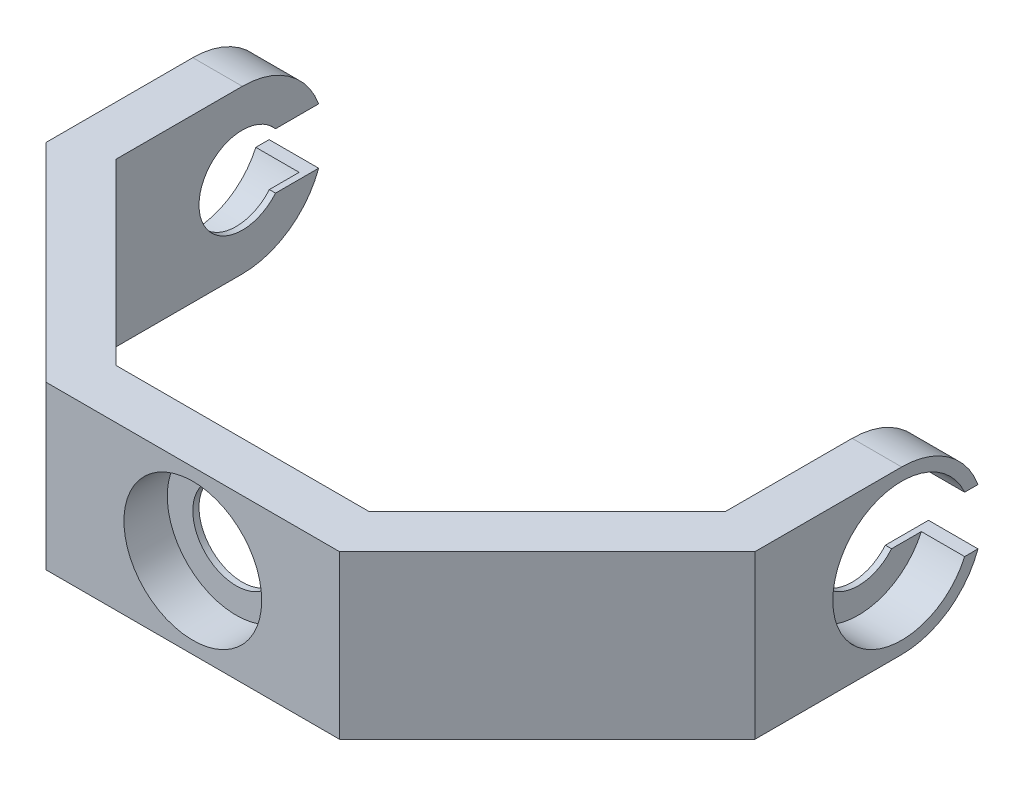
ISO-10303-21;
HEADER;
FILE_DESCRIPTION(('STEP AP214'),'2;1');
FILE_NAME('part.step','',(''),(''),'','','');
FILE_SCHEMA(('AUTOMOTIVE_DESIGN { 1 0 10303 214 1 1 1 1 }'));
ENDSEC;
DATA;
#1=APPLICATION_CONTEXT('core data for automotive mechanical design processes');
#2=APPLICATION_PROTOCOL_DEFINITION('international standard','automotive_design',2000,#1);
#3=PRODUCT_CONTEXT('',#1,'mechanical');
#4=PRODUCT('Part','Part','',(#3));
#5=PRODUCT_RELATED_PRODUCT_CATEGORY('part','',(#4));
#6=PRODUCT_DEFINITION_FORMATION('','',#4);
#7=PRODUCT_DEFINITION_CONTEXT('part definition',#1,'design');
#8=PRODUCT_DEFINITION('design','',#6,#7);
#9=PRODUCT_DEFINITION_SHAPE('','',#8);
#10=(LENGTH_UNIT() NAMED_UNIT(*) SI_UNIT(.MILLI.,.METRE.));
#11=(NAMED_UNIT(*) PLANE_ANGLE_UNIT() SI_UNIT($,.RADIAN.));
#12=(NAMED_UNIT(*) SI_UNIT($,.STERADIAN.) SOLID_ANGLE_UNIT());
#13=UNCERTAINTY_MEASURE_WITH_UNIT(LENGTH_MEASURE(1.E-05),#10,'distance_accuracy_value','');
#14=(GEOMETRIC_REPRESENTATION_CONTEXT(3) GLOBAL_UNCERTAINTY_ASSIGNED_CONTEXT((#13)) GLOBAL_UNIT_ASSIGNED_CONTEXT((#10,
#11,#12)) REPRESENTATION_CONTEXT('',''));
#15=CARTESIAN_POINT('',(0.,0.,0.));
#16=DIRECTION('',(0.,0.,1.));
#17=DIRECTION('',(1.,0.,0.));
#18=AXIS2_PLACEMENT_3D('',#15,#16,#17);
#19=CARTESIAN_POINT('',(57.2499999999999,13.125,-13.1250000000004));
#20=DIRECTION('',(-1.,0.,0.));
#21=DIRECTION('',(0.,0.,1.));
#22=AXIS2_PLACEMENT_3D('',#19,#20,#21);
#23=PLANE('',#22);
#24=CARTESIAN_POINT('',(57.25,0.,0.));
#25=DIRECTION('',(-1.,0.,0.));
#26=DIRECTION('',(0.,0.,1.));
#27=AXIS2_PLACEMENT_3D('',#24,#25,#26);
#28=CIRCLE('',#27,11.125);
#29=CARTESIAN_POINT('',(57.25,-4.5,-10.1742628725623));
#30=VERTEX_POINT('',#29);
#31=CARTESIAN_POINT('',(57.25,4.5,-10.1742628725623));
#32=VERTEX_POINT('',#31);
#33=EDGE_CURVE('E204',#30,#32,#28,.T.);
#34=ORIENTED_EDGE('',*,*,#33,.T.);
#35=DIRECTION('',(0.,0.,-1.));
#36=VECTOR('',#35,1.);
#37=CARTESIAN_POINT('',(57.25,4.5,0.));
#38=LINE('',#37,#36);
#39=CARTESIAN_POINT('',(57.25,4.5,-12.3294616670802));
#40=VERTEX_POINT('',#39);
#41=EDGE_CURVE('E217',#32,#40,#38,.T.);
#42=ORIENTED_EDGE('',*,*,#41,.T.);
#43=CARTESIAN_POINT('',(57.25,0.,0.));
#44=DIRECTION('',(-1.,0.,0.));
#45=DIRECTION('',(0.,0.,1.));
#46=AXIS2_PLACEMENT_3D('',#43,#44,#45);
#47=CIRCLE('',#46,13.125);
#48=CARTESIAN_POINT('',(57.25,13.125,0.));
#49=VERTEX_POINT('',#48);
#50=EDGE_CURVE('E232',#49,#40,#47,.T.);
#51=ORIENTED_EDGE('',*,*,#50,.F.);
#52=DIRECTION('',(0.,0.,-1.));
#53=VECTOR('',#52,1.);
#54=CARTESIAN_POINT('',(57.2499999999999,13.125,-13.1250000000004));
#55=LINE('',#54,#53);
#56=CARTESIAN_POINT('',(57.2500000000002,13.125,23.7137264458593));
#57=VERTEX_POINT('',#56);
#58=EDGE_CURVE('E313',#57,#49,#55,.T.);
#59=ORIENTED_EDGE('',*,*,#58,.F.);
#60=DIRECTION('',(0.,-1.,0.));
#61=VECTOR('',#60,1.);
#62=CARTESIAN_POINT('',(57.2500000000002,13.125,23.7137264458593));
#63=LINE('',#62,#61);
#64=CARTESIAN_POINT('',(57.2500000000002,-13.125,23.7137264458593));
#65=VERTEX_POINT('',#64);
#66=EDGE_CURVE('E343',#57,#65,#63,.T.);
#67=ORIENTED_EDGE('',*,*,#66,.T.);
#68=DIRECTION('',(0.,0.,-1.));
#69=VECTOR('',#68,1.);
#70=CARTESIAN_POINT('',(57.2499999999999,-13.125,-13.1250000000004));
#71=LINE('',#70,#69);
#72=CARTESIAN_POINT('',(57.25,-13.125,0.));
#73=VERTEX_POINT('',#72);
#74=EDGE_CURVE('E337',#65,#73,#71,.T.);
#75=ORIENTED_EDGE('',*,*,#74,.T.);
#76=CARTESIAN_POINT('',(57.25,0.,0.));
#77=DIRECTION('',(-1.,0.,0.));
#78=DIRECTION('',(0.,0.,1.));
#79=AXIS2_PLACEMENT_3D('',#76,#77,#78);
#80=CIRCLE('',#79,13.125);
#81=CARTESIAN_POINT('',(57.25,-4.5,-12.3294616670802));
#82=VERTEX_POINT('',#81);
#83=EDGE_CURVE('E388',#82,#73,#80,.T.);
#84=ORIENTED_EDGE('',*,*,#83,.F.);
#85=DIRECTION('',(0.,0.,-1.));
#86=VECTOR('',#85,1.);
#87=CARTESIAN_POINT('',(57.25,-4.5,0.));
#88=LINE('',#87,#86);
#89=EDGE_CURVE('E390',#30,#82,#88,.T.);
#90=ORIENTED_EDGE('',*,*,#89,.F.);
#91=EDGE_LOOP('',(#34,#42,#51,#59,#67,#75,#84,#90));
#92=FACE_BOUND('',#91,.T.);
#93=ADVANCED_FACE('F34',(#92),#23,.F.);
#94=CARTESIAN_POINT('',(-82.3268518000127,4.5,0.));
#95=DIRECTION('',(0.,-1.,0.));
#96=DIRECTION('',(0.,0.,-1.));
#97=AXIS2_PLACEMENT_3D('',#94,#95,#96);
#98=PLANE('',#97);
#99=ORIENTED_EDGE('',*,*,#41,.F.);
#100=DIRECTION('',(1.,0.,0.));
#101=VECTOR('',#100,1.);
#102=CARTESIAN_POINT('',(50.25,4.5,-10.1742628725623));
#103=LINE('',#102,#101);
#104=CARTESIAN_POINT('',(50.25,4.5,-10.1742628725623));
#105=VERTEX_POINT('',#104);
#106=EDGE_CURVE('E212',#105,#32,#103,.T.);
#107=ORIENTED_EDGE('',*,*,#106,.F.);
#108=DIRECTION('',(0.,0.,-1.));
#109=VECTOR('',#108,1.);
#110=CARTESIAN_POINT('',(50.25,4.5,0.));
#111=LINE('',#110,#109);
#112=CARTESIAN_POINT('',(50.25,4.5,-5.36190264738179));
#113=VERTEX_POINT('',#112);
#114=EDGE_CURVE('E196',#113,#105,#111,.T.);
#115=ORIENTED_EDGE('',*,*,#114,.F.);
#116=DIRECTION('',(1.,0.,0.));
#117=VECTOR('',#116,1.);
#118=CARTESIAN_POINT('',(-82.3268518000127,4.5,-5.3619026473818));
#119=LINE('',#118,#117);
#120=CARTESIAN_POINT('',(49.2499999999999,4.5,-5.36190264738179));
#121=VERTEX_POINT('',#120);
#122=EDGE_CURVE('E210',#121,#113,#119,.T.);
#123=ORIENTED_EDGE('',*,*,#122,.F.);
#124=DIRECTION('',(0.,0.,-1.));
#125=VECTOR('',#124,1.);
#126=CARTESIAN_POINT('',(49.2500000000001,4.5,13.1249999999996));
#127=LINE('',#126,#125);
#128=CARTESIAN_POINT('',(49.2499999999999,4.5,-12.3294616670802));
#129=VERTEX_POINT('',#128);
#130=EDGE_CURVE('E368',#121,#129,#127,.T.);
#131=ORIENTED_EDGE('',*,*,#130,.T.);
#132=DIRECTION('',(1.,0.,0.));
#133=VECTOR('',#132,1.);
#134=CARTESIAN_POINT('',(-82.3268518000127,4.5,-12.3294616670802));
#135=LINE('',#134,#133);
#136=EDGE_CURVE('E218',#129,#40,#135,.T.);
#137=ORIENTED_EDGE('',*,*,#136,.T.);
#138=EDGE_LOOP('',(#99,#107,#115,#123,#131,#137));
#139=FACE_BOUND('',#138,.T.);
#140=ADVANCED_FACE('F209',(#139),#98,.T.);
#141=CARTESIAN_POINT('',(-82.3268518000127,0.,0.));
#142=DIRECTION('',(1.,0.,0.));
#143=DIRECTION('',(0.,0.,-1.));
#144=AXIS2_PLACEMENT_3D('',#141,#142,#143);
#145=CYLINDRICAL_SURFACE('',#144,7.);
#146=ORIENTED_EDGE('',*,*,#122,.T.);
#147=CARTESIAN_POINT('',(50.25,0.,0.));
#148=DIRECTION('',(-1.,0.,0.));
#149=DIRECTION('',(0.,0.,1.));
#150=AXIS2_PLACEMENT_3D('',#147,#148,#149);
#151=CIRCLE('',#150,7.);
#152=CARTESIAN_POINT('',(50.25,-4.5,-5.36190264738179));
#153=VERTEX_POINT('',#152);
#154=EDGE_CURVE('E193',#153,#113,#151,.T.);
#155=ORIENTED_EDGE('',*,*,#154,.F.);
#156=DIRECTION('',(1.,0.,0.));
#157=VECTOR('',#156,1.);
#158=CARTESIAN_POINT('',(-82.3268518000127,-4.5,-5.3619026473818));
#159=LINE('',#158,#157);
#160=CARTESIAN_POINT('',(49.2499999999999,-4.5,-5.36190264738179));
#161=VERTEX_POINT('',#160);
#162=EDGE_CURVE('E220',#161,#153,#159,.T.);
#163=ORIENTED_EDGE('',*,*,#162,.F.);
#164=CARTESIAN_POINT('',(49.25,0.,0.));
#165=DIRECTION('',(1.,0.,0.));
#166=DIRECTION('',(0.,0.,-1.));
#167=AXIS2_PLACEMENT_3D('',#164,#165,#166);
#168=CIRCLE('',#167,7.);
#169=EDGE_CURVE('E216',#161,#121,#168,.F.);
#170=ORIENTED_EDGE('',*,*,#169,.T.);
#171=EDGE_LOOP('',(#146,#155,#163,#170));
#172=FACE_BOUND('',#171,.T.);
#173=ADVANCED_FACE('F214',(#172),#145,.F.);
#174=CARTESIAN_POINT('',(-82.3268518000127,-4.5,0.));
#175=DIRECTION('',(0.,-1.,0.));
#176=DIRECTION('',(0.,0.,-1.));
#177=AXIS2_PLACEMENT_3D('',#174,#175,#176);
#178=PLANE('',#177);
#179=DIRECTION('',(1.,0.,0.));
#180=VECTOR('',#179,1.);
#181=CARTESIAN_POINT('',(50.25,-4.5,-10.1742628725623));
#182=LINE('',#181,#180);
#183=CARTESIAN_POINT('',(50.25,-4.5,-10.1742628725623));
#184=VERTEX_POINT('',#183);
#185=EDGE_CURVE('E393',#184,#30,#182,.T.);
#186=ORIENTED_EDGE('',*,*,#185,.T.);
#187=ORIENTED_EDGE('',*,*,#89,.T.);
#188=DIRECTION('',(1.,0.,0.));
#189=VECTOR('',#188,1.);
#190=CARTESIAN_POINT('',(-82.3268518000127,-4.5,-12.3294616670802));
#191=LINE('',#190,#189);
#192=CARTESIAN_POINT('',(49.2499999999999,-4.5,-12.3294616670802));
#193=VERTEX_POINT('',#192);
#194=EDGE_CURVE('E57',#193,#82,#191,.T.);
#195=ORIENTED_EDGE('',*,*,#194,.F.);
#196=DIRECTION('',(0.,0.,-1.));
#197=VECTOR('',#196,1.);
#198=CARTESIAN_POINT('',(49.2500000000001,-4.49999999999999,13.1249999999996));
#199=LINE('',#198,#197);
#200=EDGE_CURVE('E364',#161,#193,#199,.T.);
#201=ORIENTED_EDGE('',*,*,#200,.F.);
#202=ORIENTED_EDGE('',*,*,#162,.T.);
#203=DIRECTION('',(0.,0.,-1.));
#204=VECTOR('',#203,1.);
#205=CARTESIAN_POINT('',(50.25,-4.5,0.));
#206=LINE('',#205,#204);
#207=EDGE_CURVE('E199',#153,#184,#206,.T.);
#208=ORIENTED_EDGE('',*,*,#207,.T.);
#209=EDGE_LOOP('',(#186,#187,#195,#201,#202,#208));
#210=FACE_BOUND('',#209,.T.);
#211=ADVANCED_FACE('F448',(#210),#178,.F.);
#212=CARTESIAN_POINT('',(0.,13.125,0.));
#213=DIRECTION('',(0.,1.,0.));
#214=DIRECTION('',(0.,0.,1.));
#215=AXIS2_PLACEMENT_3D('',#212,#213,#214);
#216=PLANE('',#215);
#217=ORIENTED_EDGE('',*,*,#58,.T.);
#218=DIRECTION('',(1.,0.,0.));
#219=VECTOR('',#218,1.);
#220=CARTESIAN_POINT('',(-82.3268518000127,13.125,0.));
#221=LINE('',#220,#219);
#222=CARTESIAN_POINT('',(49.2499999999999,13.125,0.));
#223=VERTEX_POINT('',#222);
#224=EDGE_CURVE('E223',#223,#49,#221,.T.);
#225=ORIENTED_EDGE('',*,*,#224,.F.);
#226=DIRECTION('',(0.,0.,1.));
#227=VECTOR('',#226,1.);
#228=CARTESIAN_POINT('',(49.2499999999999,13.125,-13.1250000000004));
#229=LINE('',#228,#227);
#230=CARTESIAN_POINT('',(49.2500000000001,13.125,20.4000179468746));
#231=VERTEX_POINT('',#230);
#232=EDGE_CURVE('E316',#223,#231,#229,.T.);
#233=ORIENTED_EDGE('',*,*,#232,.T.);
#234=DIRECTION('',(-0.707106781186544,0.,0.707106781186551));
#235=VECTOR('',#234,1.);
#236=CARTESIAN_POINT('',(49.2500000000001,13.125,20.4000179468746));
#237=LINE('',#236,#235);
#238=CARTESIAN_POINT('',(20.4000179468752,13.125,49.2499999999998));
#239=VERTEX_POINT('',#238);
#240=EDGE_CURVE('E294',#231,#239,#237,.T.);
#241=ORIENTED_EDGE('',*,*,#240,.T.);
#242=DIRECTION('',(-1.,0.,0.));
#243=VECTOR('',#242,1.);
#244=CARTESIAN_POINT('',(-20.4000179468749,13.125,49.25));
#245=LINE('',#244,#243);
#246=CARTESIAN_POINT('',(-20.4000179468749,13.125,49.25));
#247=VERTEX_POINT('',#246);
#248=EDGE_CURVE('E297',#239,#247,#245,.T.);
#249=ORIENTED_EDGE('',*,*,#248,.T.);
#250=DIRECTION('',(-0.707106781186549,0.,-0.707106781186546));
#251=VECTOR('',#250,1.);
#252=CARTESIAN_POINT('',(-49.25,13.125,20.400017946875));
#253=LINE('',#252,#251);
#254=CARTESIAN_POINT('',(-49.25,13.125,20.400017946875));
#255=VERTEX_POINT('',#254);
#256=EDGE_CURVE('E300',#247,#255,#253,.T.);
#257=ORIENTED_EDGE('',*,*,#256,.T.);
#258=DIRECTION('',(0.,0.,-1.));
#259=VECTOR('',#258,1.);
#260=CARTESIAN_POINT('',(-49.25,13.125,13.125));
#261=LINE('',#260,#259);
#262=CARTESIAN_POINT('',(-49.25,13.125,0.));
#263=VERTEX_POINT('',#262);
#264=EDGE_CURVE('E302',#255,#263,#261,.T.);
#265=ORIENTED_EDGE('',*,*,#264,.T.);
#266=DIRECTION('',(-1.,0.,0.));
#267=VECTOR('',#266,1.);
#268=CARTESIAN_POINT('',(-16.1731481999874,13.125,0.));
#269=LINE('',#268,#267);
#270=CARTESIAN_POINT('',(-57.25,13.125,0.));
#271=VERTEX_POINT('',#270);
#272=EDGE_CURVE('E281',#263,#271,#269,.T.);
#273=ORIENTED_EDGE('',*,*,#272,.T.);
#274=DIRECTION('',(0.,0.,1.));
#275=VECTOR('',#274,1.);
#276=CARTESIAN_POINT('',(-57.25,13.125,-13.125));
#277=LINE('',#276,#275);
#278=CARTESIAN_POINT('',(-57.25,13.125,23.7137264458598));
#279=VERTEX_POINT('',#278);
#280=EDGE_CURVE('E305',#271,#279,#277,.T.);
#281=ORIENTED_EDGE('',*,*,#280,.T.);
#282=DIRECTION('',(0.707106781186549,0.,0.707106781186546));
#283=VECTOR('',#282,1.);
#284=CARTESIAN_POINT('',(-57.25,13.125,23.7137264458598));
#285=LINE('',#284,#283);
#286=CARTESIAN_POINT('',(-23.7137264458596,13.125,57.25));
#287=VERTEX_POINT('',#286);
#288=EDGE_CURVE('E307',#279,#287,#285,.T.);
#289=ORIENTED_EDGE('',*,*,#288,.T.);
#290=DIRECTION('',(1.,0.,0.));
#291=VECTOR('',#290,1.);
#292=CARTESIAN_POINT('',(-23.7137264458596,13.125,57.25));
#293=LINE('',#292,#291);
#294=CARTESIAN_POINT('',(23.71372644586,13.125,57.2499999999998));
#295=VERTEX_POINT('',#294);
#296=EDGE_CURVE('E309',#287,#295,#293,.T.);
#297=ORIENTED_EDGE('',*,*,#296,.T.);
#298=DIRECTION('',(0.707106781186544,0.,-0.707106781186551));
#299=VECTOR('',#298,1.);
#300=CARTESIAN_POINT('',(57.2500000000002,13.125,23.7137264458593));
#301=LINE('',#300,#299);
#302=EDGE_CURVE('E311',#295,#57,#301,.T.);
#303=ORIENTED_EDGE('',*,*,#302,.T.);
#304=EDGE_LOOP('',(#217,#225,#233,#241,#249,#257,#265,#273,#281,#289,#297,#303));
#305=FACE_BOUND('',#304,.T.);
#306=ADVANCED_FACE('F381',(#305),#216,.T.);
#307=CARTESIAN_POINT('',(0.,-13.125,0.));
#308=DIRECTION('',(0.,1.,0.));
#309=DIRECTION('',(0.,0.,1.));
#310=AXIS2_PLACEMENT_3D('',#307,#308,#309);
#311=PLANE('',#310);
#312=DIRECTION('',(1.,0.,0.));
#313=VECTOR('',#312,1.);
#314=CARTESIAN_POINT('',(-82.3268518000127,-13.125,0.));
#315=LINE('',#314,#313);
#316=CARTESIAN_POINT('',(49.2499999999999,-13.125,0.));
#317=VERTEX_POINT('',#316);
#318=EDGE_CURVE('E229',#317,#73,#315,.T.);
#319=ORIENTED_EDGE('',*,*,#318,.T.);
#320=ORIENTED_EDGE('',*,*,#74,.F.);
#321=DIRECTION('',(0.707106781186544,0.,-0.707106781186551));
#322=VECTOR('',#321,1.);
#323=CARTESIAN_POINT('',(57.2500000000002,-13.125,23.7137264458593));
#324=LINE('',#323,#322);
#325=CARTESIAN_POINT('',(23.71372644586,-13.125,57.2499999999998));
#326=VERTEX_POINT('',#325);
#327=EDGE_CURVE('E335',#326,#65,#324,.T.);
#328=ORIENTED_EDGE('',*,*,#327,.F.);
#329=DIRECTION('',(1.,0.,0.));
#330=VECTOR('',#329,1.);
#331=CARTESIAN_POINT('',(-23.7137264458596,-13.125,57.25));
#332=LINE('',#331,#330);
#333=CARTESIAN_POINT('',(-23.7137264458596,-13.125,57.25));
#334=VERTEX_POINT('',#333);
#335=EDGE_CURVE('E333',#334,#326,#332,.T.);
#336=ORIENTED_EDGE('',*,*,#335,.F.);
#337=DIRECTION('',(0.707106781186549,0.,0.707106781186546));
#338=VECTOR('',#337,1.);
#339=CARTESIAN_POINT('',(-57.25,-13.125,23.7137264458598));
#340=LINE('',#339,#338);
#341=CARTESIAN_POINT('',(-57.25,-13.125,23.7137264458598));
#342=VERTEX_POINT('',#341);
#343=EDGE_CURVE('E331',#342,#334,#340,.T.);
#344=ORIENTED_EDGE('',*,*,#343,.F.);
#345=DIRECTION('',(0.,0.,1.));
#346=VECTOR('',#345,1.);
#347=CARTESIAN_POINT('',(-57.25,-13.125,-13.125));
#348=LINE('',#347,#346);
#349=CARTESIAN_POINT('',(-57.25,-13.125,0.));
#350=VERTEX_POINT('',#349);
#351=EDGE_CURVE('E329',#350,#342,#348,.T.);
#352=ORIENTED_EDGE('',*,*,#351,.F.);
#353=DIRECTION('',(-1.,0.,0.));
#354=VECTOR('',#353,1.);
#355=CARTESIAN_POINT('',(-16.1731481999874,-13.125,0.));
#356=LINE('',#355,#354);
#357=CARTESIAN_POINT('',(-49.25,-13.125,0.));
#358=VERTEX_POINT('',#357);
#359=EDGE_CURVE('E279',#358,#350,#356,.T.);
#360=ORIENTED_EDGE('',*,*,#359,.F.);
#361=DIRECTION('',(0.,0.,-1.));
#362=VECTOR('',#361,1.);
#363=CARTESIAN_POINT('',(-49.25,-13.125,-13.125));
#364=LINE('',#363,#362);
#365=CARTESIAN_POINT('',(-49.25,-13.125,20.400017946875));
#366=VERTEX_POINT('',#365);
#367=EDGE_CURVE('E326',#366,#358,#364,.T.);
#368=ORIENTED_EDGE('',*,*,#367,.F.);
#369=DIRECTION('',(-0.707106781186549,0.,-0.707106781186546));
#370=VECTOR('',#369,1.);
#371=CARTESIAN_POINT('',(-49.25,-13.125,20.400017946875));
#372=LINE('',#371,#370);
#373=CARTESIAN_POINT('',(-20.4000179468749,-13.125,49.25));
#374=VERTEX_POINT('',#373);
#375=EDGE_CURVE('E323',#374,#366,#372,.T.);
#376=ORIENTED_EDGE('',*,*,#375,.F.);
#377=DIRECTION('',(-1.,0.,0.));
#378=VECTOR('',#377,1.);
#379=CARTESIAN_POINT('',(-20.4000179468749,-13.125,49.25));
#380=LINE('',#379,#378);
#381=CARTESIAN_POINT('',(20.4000179468752,-13.125,49.2499999999998));
#382=VERTEX_POINT('',#381);
#383=EDGE_CURVE('E321',#382,#374,#380,.T.);
#384=ORIENTED_EDGE('',*,*,#383,.F.);
#385=DIRECTION('',(-0.707106781186544,0.,0.707106781186551));
#386=VECTOR('',#385,1.);
#387=CARTESIAN_POINT('',(49.2500000000001,-13.125,20.4000179468746));
#388=LINE('',#387,#386);
#389=CARTESIAN_POINT('',(49.2500000000001,-13.125,20.4000179468746));
#390=VERTEX_POINT('',#389);
#391=EDGE_CURVE('E293',#390,#382,#388,.T.);
#392=ORIENTED_EDGE('',*,*,#391,.F.);
#393=DIRECTION('',(0.,0.,1.));
#394=VECTOR('',#393,1.);
#395=CARTESIAN_POINT('',(49.2500000000001,-13.125,13.1249999999996));
#396=LINE('',#395,#394);
#397=EDGE_CURVE('E298',#317,#390,#396,.T.);
#398=ORIENTED_EDGE('',*,*,#397,.F.);
#399=EDGE_LOOP('',(#319,#320,#328,#336,#344,#352,#360,#368,#376,#384,#392,#398));
#400=FACE_BOUND('',#399,.T.);
#401=ADVANCED_FACE('F443',(#400),#311,.F.);
#402=CARTESIAN_POINT('',(-16.1731481999874,0.,0.));
#403=DIRECTION('',(-1.,0.,0.));
#404=DIRECTION('',(0.,0.,1.));
#405=AXIS2_PLACEMENT_3D('',#402,#403,#404);
#406=CYLINDRICAL_SURFACE('',#405,7.);
#407=CARTESIAN_POINT('',(-50.25,0.,0.));
#408=DIRECTION('',(-1.,0.,0.));
#409=DIRECTION('',(0.,0.,1.));
#410=AXIS2_PLACEMENT_3D('',#407,#408,#409);
#411=CIRCLE('',#410,7.);
#412=CARTESIAN_POINT('',(-50.25,-4.5,-5.36190264738179));
#413=VERTEX_POINT('',#412);
#414=CARTESIAN_POINT('',(-50.25,4.5,-5.36190264738179));
#415=VERTEX_POINT('',#414);
#416=EDGE_CURVE('E235',#413,#415,#411,.T.);
#417=ORIENTED_EDGE('',*,*,#416,.T.);
#418=DIRECTION('',(-1.,0.,0.));
#419=VECTOR('',#418,1.);
#420=CARTESIAN_POINT('',(-16.1731481999874,4.5,-5.36190264738179));
#421=LINE('',#420,#419);
#422=CARTESIAN_POINT('',(-49.25,4.5,-5.36190264738179));
#423=VERTEX_POINT('',#422);
#424=EDGE_CURVE('E287',#423,#415,#421,.T.);
#425=ORIENTED_EDGE('',*,*,#424,.F.);
#426=CARTESIAN_POINT('',(-49.25,0.,0.));
#427=DIRECTION('',(-1.,0.,0.));
#428=DIRECTION('',(0.,0.,1.));
#429=AXIS2_PLACEMENT_3D('',#426,#427,#428);
#430=CIRCLE('',#429,7.);
#431=CARTESIAN_POINT('',(-49.25,-4.5,-5.36190264738179));
#432=VERTEX_POINT('',#431);
#433=EDGE_CURVE('E266',#423,#432,#430,.F.);
#434=ORIENTED_EDGE('',*,*,#433,.T.);
#435=DIRECTION('',(-1.,0.,0.));
#436=VECTOR('',#435,1.);
#437=CARTESIAN_POINT('',(-16.1731481999874,-4.5,-5.36190264738179));
#438=LINE('',#437,#436);
#439=EDGE_CURVE('E276',#432,#413,#438,.T.);
#440=ORIENTED_EDGE('',*,*,#439,.T.);
#441=EDGE_LOOP('',(#417,#425,#434,#440));
#442=FACE_BOUND('',#441,.T.);
#443=ADVANCED_FACE('F480',(#442),#406,.F.);
#444=CARTESIAN_POINT('',(-49.25,13.125,-13.125));
#445=DIRECTION('',(-1.,0.,0.));
#446=DIRECTION('',(0.,0.,1.));
#447=AXIS2_PLACEMENT_3D('',#444,#445,#446);
#448=PLANE('',#447);
#449=CARTESIAN_POINT('',(-49.25,0.,0.));
#450=DIRECTION('',(-1.,0.,0.));
#451=DIRECTION('',(0.,0.,1.));
#452=AXIS2_PLACEMENT_3D('',#449,#450,#451);
#453=CIRCLE('',#452,13.125);
#454=CARTESIAN_POINT('',(-49.25,-4.5,-12.3294616670802));
#455=VERTEX_POINT('',#454);
#456=EDGE_CURVE('E260',#358,#455,#453,.F.);
#457=ORIENTED_EDGE('',*,*,#456,.T.);
#458=DIRECTION('',(0.,0.,1.));
#459=VECTOR('',#458,1.);
#460=CARTESIAN_POINT('',(-49.25,-4.5,0.));
#461=LINE('',#460,#459);
#462=EDGE_CURVE('E263',#455,#432,#461,.T.);
#463=ORIENTED_EDGE('',*,*,#462,.T.);
#464=ORIENTED_EDGE('',*,*,#433,.F.);
#465=DIRECTION('',(0.,0.,1.));
#466=VECTOR('',#465,1.);
#467=CARTESIAN_POINT('',(-49.25,4.5,0.));
#468=LINE('',#467,#466);
#469=CARTESIAN_POINT('',(-49.25,4.5,-12.3294616670802));
#470=VERTEX_POINT('',#469);
#471=EDGE_CURVE('E254',#470,#423,#468,.T.);
#472=ORIENTED_EDGE('',*,*,#471,.F.);
#473=CARTESIAN_POINT('',(-49.25,0.,0.));
#474=DIRECTION('',(-1.,0.,0.));
#475=DIRECTION('',(0.,0.,1.));
#476=AXIS2_PLACEMENT_3D('',#473,#474,#475);
#477=CIRCLE('',#476,13.125);
#478=EDGE_CURVE('E256',#470,#263,#477,.F.);
#479=ORIENTED_EDGE('',*,*,#478,.T.);
#480=ORIENTED_EDGE('',*,*,#264,.F.);
#481=DIRECTION('',(0.,-1.,0.));
#482=VECTOR('',#481,1.);
#483=CARTESIAN_POINT('',(-49.25,13.125,20.400017946875));
#484=LINE('',#483,#482);
#485=EDGE_CURVE('E355',#255,#366,#484,.T.);
#486=ORIENTED_EDGE('',*,*,#485,.T.);
#487=ORIENTED_EDGE('',*,*,#367,.T.);
#488=EDGE_LOOP('',(#457,#463,#464,#472,#479,#480,#486,#487));
#489=FACE_BOUND('',#488,.T.);
#490=ADVANCED_FACE('F476',(#489),#448,.F.);
#491=CARTESIAN_POINT('',(-57.25,13.125,-13.125));
#492=DIRECTION('',(1.,0.,0.));
#493=DIRECTION('',(0.,0.,-1.));
#494=AXIS2_PLACEMENT_3D('',#491,#492,#493);
#495=PLANE('',#494);
#496=DIRECTION('',(0.,0.,-1.));
#497=VECTOR('',#496,1.);
#498=CARTESIAN_POINT('',(-57.25,4.5,0.));
#499=LINE('',#498,#497);
#500=CARTESIAN_POINT('',(-57.25,4.5,-10.1742628725623));
#501=VERTEX_POINT('',#500);
#502=CARTESIAN_POINT('',(-57.25,4.5,-12.3294616670802));
#503=VERTEX_POINT('',#502);
#504=EDGE_CURVE('E268',#501,#503,#499,.T.);
#505=ORIENTED_EDGE('',*,*,#504,.F.);
#506=CARTESIAN_POINT('',(-57.25,0.,0.));
#507=DIRECTION('',(-1.,0.,0.));
#508=DIRECTION('',(0.,0.,1.));
#509=AXIS2_PLACEMENT_3D('',#506,#507,#508);
#510=CIRCLE('',#509,11.125);
#511=CARTESIAN_POINT('',(-57.25,-4.5,-10.1742628725623));
#512=VERTEX_POINT('',#511);
#513=EDGE_CURVE('E234',#512,#501,#510,.T.);
#514=ORIENTED_EDGE('',*,*,#513,.F.);
#515=DIRECTION('',(0.,0.,-1.));
#516=VECTOR('',#515,1.);
#517=CARTESIAN_POINT('',(-57.25,-4.5,0.));
#518=LINE('',#517,#516);
#519=CARTESIAN_POINT('',(-57.25,-4.5,-12.3294616670802));
#520=VERTEX_POINT('',#519);
#521=EDGE_CURVE('E252',#512,#520,#518,.T.);
#522=ORIENTED_EDGE('',*,*,#521,.T.);
#523=CARTESIAN_POINT('',(-57.25,0.,0.));
#524=DIRECTION('',(-1.,0.,0.));
#525=DIRECTION('',(0.,0.,1.));
#526=AXIS2_PLACEMENT_3D('',#523,#524,#525);
#527=CIRCLE('',#526,13.125);
#528=EDGE_CURVE('E273',#520,#350,#527,.T.);
#529=ORIENTED_EDGE('',*,*,#528,.T.);
#530=ORIENTED_EDGE('',*,*,#351,.T.);
#531=DIRECTION('',(0.,-1.,0.));
#532=VECTOR('',#531,1.);
#533=CARTESIAN_POINT('',(-57.25,13.125,23.7137264458598));
#534=LINE('',#533,#532);
#535=EDGE_CURVE('E352',#279,#342,#534,.T.);
#536=ORIENTED_EDGE('',*,*,#535,.F.);
#537=ORIENTED_EDGE('',*,*,#280,.F.);
#538=CARTESIAN_POINT('',(-57.25,0.,0.));
#539=DIRECTION('',(-1.,0.,0.));
#540=DIRECTION('',(0.,0.,1.));
#541=AXIS2_PLACEMENT_3D('',#538,#539,#540);
#542=CIRCLE('',#541,13.125);
#543=EDGE_CURVE('E270',#271,#503,#542,.T.);
#544=ORIENTED_EDGE('',*,*,#543,.T.);
#545=EDGE_LOOP('',(#505,#514,#522,#529,#530,#536,#537,#544));
#546=FACE_BOUND('',#545,.T.);
#547=ADVANCED_FACE('F473',(#546),#495,.F.);
#548=CARTESIAN_POINT('',(49.2500000000001,13.125,20.4000179468746));
#549=DIRECTION('',(0.707106781186551,0.,0.707106781186544));
#550=DIRECTION('',(0.707106781186544,0.,-0.707106781186551));
#551=AXIS2_PLACEMENT_3D('',#548,#549,#550);
#552=PLANE('',#551);
#553=ORIENTED_EDGE('',*,*,#391,.T.);
#554=DIRECTION('',(0.,-1.,0.));
#555=VECTOR('',#554,1.);
#556=CARTESIAN_POINT('',(20.4000179468752,13.125,49.2499999999998));
#557=LINE('',#556,#555);
#558=EDGE_CURVE('E361',#239,#382,#557,.T.);
#559=ORIENTED_EDGE('',*,*,#558,.F.);
#560=ORIENTED_EDGE('',*,*,#240,.F.);
#561=DIRECTION('',(0.,-1.,0.));
#562=VECTOR('',#561,1.);
#563=CARTESIAN_POINT('',(49.2500000000001,13.125,20.4000179468746));
#564=LINE('',#563,#562);
#565=EDGE_CURVE('E318',#231,#390,#564,.T.);
#566=ORIENTED_EDGE('',*,*,#565,.T.);
#567=EDGE_LOOP('',(#553,#559,#560,#566));
#568=FACE_BOUND('',#567,.T.);
#569=ADVANCED_FACE('F36',(#568),#552,.F.);
#570=CARTESIAN_POINT('',(-20.4000179468749,13.125,49.25));
#571=DIRECTION('',(0.,0.,1.));
#572=DIRECTION('',(1.,0.,0.));
#573=AXIS2_PLACEMENT_3D('',#570,#571,#572);
#574=PLANE('',#573);
#575=CARTESIAN_POINT('',(0.,0.,49.2499999999999));
#576=DIRECTION('',(0.,0.,1.));
#577=DIRECTION('',(1.,0.,0.));
#578=AXIS2_PLACEMENT_3D('',#575,#576,#577);
#579=CIRCLE('',#578,7.);
#580=CARTESIAN_POINT('',(7.,0.,49.2499999999999));
#581=VERTEX_POINT('',#580);
#582=EDGE_CURVE('E405',#581,#581,#579,.F.);
#583=ORIENTED_EDGE('',*,*,#582,.F.);
#584=EDGE_LOOP('',(#583));
#585=FACE_BOUND('',#584,.T.);
#586=ORIENTED_EDGE('',*,*,#383,.T.);
#587=DIRECTION('',(0.,-1.,0.));
#588=VECTOR('',#587,1.);
#589=CARTESIAN_POINT('',(-20.4000179468749,13.125,49.25));
#590=LINE('',#589,#588);
#591=EDGE_CURVE('E358',#247,#374,#590,.T.);
#592=ORIENTED_EDGE('',*,*,#591,.F.);
#593=ORIENTED_EDGE('',*,*,#248,.F.);
#594=ORIENTED_EDGE('',*,*,#558,.T.);
#595=EDGE_LOOP('',(#586,#592,#593,#594));
#596=FACE_BOUND('',#595,.T.);
#597=ADVANCED_FACE('F483',(#585,#596),#574,.F.);
#598=CARTESIAN_POINT('',(-49.25,13.125,20.400017946875));
#599=DIRECTION('',(-0.707106781186546,0.,0.707106781186549));
#600=DIRECTION('',(0.707106781186549,0.,0.707106781186546));
#601=AXIS2_PLACEMENT_3D('',#598,#599,#600);
#602=PLANE('',#601);
#603=ORIENTED_EDGE('',*,*,#375,.T.);
#604=ORIENTED_EDGE('',*,*,#485,.F.);
#605=ORIENTED_EDGE('',*,*,#256,.F.);
#606=ORIENTED_EDGE('',*,*,#591,.T.);
#607=EDGE_LOOP('',(#603,#604,#605,#606));
#608=FACE_BOUND('',#607,.T.);
#609=ADVANCED_FACE('F471',(#608),#602,.F.);
#610=CARTESIAN_POINT('',(-57.25,13.125,23.7137264458598));
#611=DIRECTION('',(0.707106781186546,0.,-0.707106781186549));
#612=DIRECTION('',(-0.707106781186549,0.,-0.707106781186546));
#613=AXIS2_PLACEMENT_3D('',#610,#611,#612);
#614=PLANE('',#613);
#615=ORIENTED_EDGE('',*,*,#343,.T.);
#616=DIRECTION('',(0.,-1.,0.));
#617=VECTOR('',#616,1.);
#618=CARTESIAN_POINT('',(-23.7137264458596,13.125,57.25));
#619=LINE('',#618,#617);
#620=EDGE_CURVE('E349',#287,#334,#619,.T.);
#621=ORIENTED_EDGE('',*,*,#620,.F.);
#622=ORIENTED_EDGE('',*,*,#288,.F.);
#623=ORIENTED_EDGE('',*,*,#535,.T.);
#624=EDGE_LOOP('',(#615,#621,#622,#623));
#625=FACE_BOUND('',#624,.T.);
#626=ADVANCED_FACE('F433',(#625),#614,.F.);
#627=CARTESIAN_POINT('',(-23.7137264458596,13.125,57.25));
#628=DIRECTION('',(0.,0.,-1.));
#629=DIRECTION('',(-1.,0.,0.));
#630=AXIS2_PLACEMENT_3D('',#627,#628,#629);
#631=PLANE('',#630);
#632=CARTESIAN_POINT('',(0.,0.,57.2499999999999));
#633=DIRECTION('',(0.,0.,1.));
#634=DIRECTION('',(1.,0.,0.));
#635=AXIS2_PLACEMENT_3D('',#632,#633,#634);
#636=CIRCLE('',#635,11.125);
#637=CARTESIAN_POINT('',(11.125,0.,57.2499999999999));
#638=VERTEX_POINT('',#637);
#639=EDGE_CURVE('E402',#638,#638,#636,.T.);
#640=ORIENTED_EDGE('',*,*,#639,.F.);
#641=EDGE_LOOP('',(#640));
#642=FACE_BOUND('',#641,.T.);
#643=ORIENTED_EDGE('',*,*,#335,.T.);
#644=DIRECTION('',(0.,-1.,0.));
#645=VECTOR('',#644,1.);
#646=CARTESIAN_POINT('',(23.71372644586,13.125,57.2499999999998));
#647=LINE('',#646,#645);
#648=EDGE_CURVE('E346',#295,#326,#647,.T.);
#649=ORIENTED_EDGE('',*,*,#648,.F.);
#650=ORIENTED_EDGE('',*,*,#296,.F.);
#651=ORIENTED_EDGE('',*,*,#620,.T.);
#652=EDGE_LOOP('',(#643,#649,#650,#651));
#653=FACE_BOUND('',#652,.T.);
#654=ADVANCED_FACE('F429',(#642,#653),#631,.F.);
#655=CARTESIAN_POINT('',(57.2500000000002,13.125,23.7137264458593));
#656=DIRECTION('',(-0.707106781186551,0.,-0.707106781186544));
#657=DIRECTION('',(-0.707106781186544,0.,0.707106781186551));
#658=AXIS2_PLACEMENT_3D('',#655,#656,#657);
#659=PLANE('',#658);
#660=ORIENTED_EDGE('',*,*,#327,.T.);
#661=ORIENTED_EDGE('',*,*,#66,.F.);
#662=ORIENTED_EDGE('',*,*,#302,.F.);
#663=ORIENTED_EDGE('',*,*,#648,.T.);
#664=EDGE_LOOP('',(#660,#661,#662,#663));
#665=FACE_BOUND('',#664,.T.);
#666=ADVANCED_FACE('F432',(#665),#659,.F.);
#667=CARTESIAN_POINT('',(49.2500000000001,13.125,13.1249999999996));
#668=DIRECTION('',(1.,0.,0.));
#669=DIRECTION('',(0.,0.,-1.));
#670=AXIS2_PLACEMENT_3D('',#667,#668,#669);
#671=PLANE('',#670);
#672=ORIENTED_EDGE('',*,*,#200,.T.);
#673=CARTESIAN_POINT('',(49.25,0.,0.));
#674=DIRECTION('',(1.,0.,0.));
#675=DIRECTION('',(0.,0.,-1.));
#676=AXIS2_PLACEMENT_3D('',#673,#674,#675);
#677=CIRCLE('',#676,13.125);
#678=EDGE_CURVE('E11',#193,#317,#677,.F.);
#679=ORIENTED_EDGE('',*,*,#678,.T.);
#680=ORIENTED_EDGE('',*,*,#397,.T.);
#681=ORIENTED_EDGE('',*,*,#565,.F.);
#682=ORIENTED_EDGE('',*,*,#232,.F.);
#683=CARTESIAN_POINT('',(49.25,0.,0.));
#684=DIRECTION('',(1.,0.,0.));
#685=DIRECTION('',(0.,0.,-1.));
#686=AXIS2_PLACEMENT_3D('',#683,#684,#685);
#687=CIRCLE('',#686,13.125);
#688=EDGE_CURVE('E42',#223,#129,#687,.F.);
#689=ORIENTED_EDGE('',*,*,#688,.T.);
#690=ORIENTED_EDGE('',*,*,#130,.F.);
#691=ORIENTED_EDGE('',*,*,#169,.F.);
#692=EDGE_LOOP('',(#672,#679,#680,#681,#682,#689,#690,#691));
#693=FACE_BOUND('',#692,.T.);
#694=ADVANCED_FACE('F372',(#693),#671,.F.);
#695=CARTESIAN_POINT('',(-16.1731481999874,-4.5,0.));
#696=DIRECTION('',(0.,1.,0.));
#697=DIRECTION('',(0.,0.,1.));
#698=AXIS2_PLACEMENT_3D('',#695,#696,#697);
#699=PLANE('',#698);
#700=DIRECTION('',(-1.,0.,0.));
#701=VECTOR('',#700,1.);
#702=CARTESIAN_POINT('',(-50.25,-4.5,-10.1742628725623));
#703=LINE('',#702,#701);
#704=CARTESIAN_POINT('',(-50.25,-4.5,-10.1742628725623));
#705=VERTEX_POINT('',#704);
#706=EDGE_CURVE('E247',#705,#512,#703,.T.);
#707=ORIENTED_EDGE('',*,*,#706,.F.);
#708=DIRECTION('',(0.,0.,-1.));
#709=VECTOR('',#708,1.);
#710=CARTESIAN_POINT('',(-50.25,-4.5,0.));
#711=LINE('',#710,#709);
#712=EDGE_CURVE('E238',#413,#705,#711,.T.);
#713=ORIENTED_EDGE('',*,*,#712,.F.);
#714=ORIENTED_EDGE('',*,*,#439,.F.);
#715=ORIENTED_EDGE('',*,*,#462,.F.);
#716=DIRECTION('',(-1.,0.,0.));
#717=VECTOR('',#716,1.);
#718=CARTESIAN_POINT('',(-16.1731481999874,-4.5,-12.3294616670802));
#719=LINE('',#718,#717);
#720=EDGE_CURVE('E257',#455,#520,#719,.T.);
#721=ORIENTED_EDGE('',*,*,#720,.T.);
#722=ORIENTED_EDGE('',*,*,#521,.F.);
#723=EDGE_LOOP('',(#707,#713,#714,#715,#721,#722));
#724=FACE_BOUND('',#723,.T.);
#725=ADVANCED_FACE('F517',(#724),#699,.T.);
#726=CARTESIAN_POINT('',(-16.1731481999874,0.,0.));
#727=DIRECTION('',(-1.,0.,0.));
#728=DIRECTION('',(0.,0.,1.));
#729=AXIS2_PLACEMENT_3D('',#726,#727,#728);
#730=CYLINDRICAL_SURFACE('',#729,13.125);
#731=ORIENTED_EDGE('',*,*,#359,.T.);
#732=ORIENTED_EDGE('',*,*,#528,.F.);
#733=ORIENTED_EDGE('',*,*,#720,.F.);
#734=ORIENTED_EDGE('',*,*,#456,.F.);
#735=EDGE_LOOP('',(#731,#732,#733,#734));
#736=FACE_BOUND('',#735,.T.);
#737=ADVANCED_FACE('F514',(#736),#730,.T.);
#738=CARTESIAN_POINT('',(-16.1731481999874,0.,0.));
#739=DIRECTION('',(-1.,0.,0.));
#740=DIRECTION('',(0.,0.,1.));
#741=AXIS2_PLACEMENT_3D('',#738,#739,#740);
#742=CYLINDRICAL_SURFACE('',#741,13.125);
#743=DIRECTION('',(-1.,0.,0.));
#744=VECTOR('',#743,1.);
#745=CARTESIAN_POINT('',(-16.1731481999874,4.5,-12.3294616670802));
#746=LINE('',#745,#744);
#747=EDGE_CURVE('E284',#470,#503,#746,.T.);
#748=ORIENTED_EDGE('',*,*,#747,.T.);
#749=ORIENTED_EDGE('',*,*,#543,.F.);
#750=ORIENTED_EDGE('',*,*,#272,.F.);
#751=ORIENTED_EDGE('',*,*,#478,.F.);
#752=EDGE_LOOP('',(#748,#749,#750,#751));
#753=FACE_BOUND('',#752,.T.);
#754=ADVANCED_FACE('F526',(#753),#742,.T.);
#755=CARTESIAN_POINT('',(-16.1731481999874,4.5,0.));
#756=DIRECTION('',(0.,1.,0.));
#757=DIRECTION('',(0.,0.,1.));
#758=AXIS2_PLACEMENT_3D('',#755,#756,#757);
#759=PLANE('',#758);
#760=DIRECTION('',(0.,0.,-1.));
#761=VECTOR('',#760,1.);
#762=CARTESIAN_POINT('',(-50.25,4.5,0.));
#763=LINE('',#762,#761);
#764=CARTESIAN_POINT('',(-50.25,4.5,-10.1742628725623));
#765=VERTEX_POINT('',#764);
#766=EDGE_CURVE('E244',#415,#765,#763,.T.);
#767=ORIENTED_EDGE('',*,*,#766,.T.);
#768=DIRECTION('',(-1.,0.,0.));
#769=VECTOR('',#768,1.);
#770=CARTESIAN_POINT('',(-50.25,4.5,-10.1742628725623));
#771=LINE('',#770,#769);
#772=EDGE_CURVE('E249',#765,#501,#771,.T.);
#773=ORIENTED_EDGE('',*,*,#772,.T.);
#774=ORIENTED_EDGE('',*,*,#504,.T.);
#775=ORIENTED_EDGE('',*,*,#747,.F.);
#776=ORIENTED_EDGE('',*,*,#471,.T.);
#777=ORIENTED_EDGE('',*,*,#424,.T.);
#778=EDGE_LOOP('',(#767,#773,#774,#775,#776,#777));
#779=FACE_BOUND('',#778,.T.);
#780=ADVANCED_FACE('F524',(#779),#759,.F.);
#781=CARTESIAN_POINT('',(-50.25,0.,0.));
#782=DIRECTION('',(-1.,0.,0.));
#783=DIRECTION('',(0.,0.,1.));
#784=AXIS2_PLACEMENT_3D('',#781,#782,#783);
#785=CYLINDRICAL_SURFACE('',#784,11.125);
#786=ORIENTED_EDGE('',*,*,#513,.T.);
#787=ORIENTED_EDGE('',*,*,#772,.F.);
#788=CARTESIAN_POINT('',(-50.25,0.,0.));
#789=DIRECTION('',(-1.,0.,0.));
#790=DIRECTION('',(0.,0.,1.));
#791=AXIS2_PLACEMENT_3D('',#788,#789,#790);
#792=CIRCLE('',#791,11.125);
#793=EDGE_CURVE('E241',#705,#765,#792,.T.);
#794=ORIENTED_EDGE('',*,*,#793,.F.);
#795=ORIENTED_EDGE('',*,*,#706,.T.);
#796=EDGE_LOOP('',(#786,#787,#794,#795));
#797=FACE_BOUND('',#796,.T.);
#798=ADVANCED_FACE('F533',(#797),#785,.F.);
#799=CARTESIAN_POINT('',(-50.25,0.,0.));
#800=DIRECTION('',(-1.,0.,0.));
#801=DIRECTION('',(0.,0.,1.));
#802=AXIS2_PLACEMENT_3D('',#799,#800,#801);
#803=PLANE('',#802);
#804=ORIENTED_EDGE('',*,*,#416,.F.);
#805=ORIENTED_EDGE('',*,*,#712,.T.);
#806=ORIENTED_EDGE('',*,*,#793,.T.);
#807=ORIENTED_EDGE('',*,*,#766,.F.);
#808=EDGE_LOOP('',(#804,#805,#806,#807));
#809=FACE_BOUND('',#808,.T.);
#810=ADVANCED_FACE('F622',(#809),#803,.T.);
#811=CARTESIAN_POINT('',(-82.3268518000127,0.,0.));
#812=DIRECTION('',(1.,0.,0.));
#813=DIRECTION('',(0.,0.,-1.));
#814=AXIS2_PLACEMENT_3D('',#811,#812,#813);
#815=CYLINDRICAL_SURFACE('',#814,13.125);
#816=ORIENTED_EDGE('',*,*,#194,.T.);
#817=ORIENTED_EDGE('',*,*,#83,.T.);
#818=ORIENTED_EDGE('',*,*,#318,.F.);
#819=ORIENTED_EDGE('',*,*,#678,.F.);
#820=EDGE_LOOP('',(#816,#817,#818,#819));
#821=FACE_BOUND('',#820,.T.);
#822=ADVANCED_FACE('F447',(#821),#815,.T.);
#823=CARTESIAN_POINT('',(-82.3268518000127,0.,0.));
#824=DIRECTION('',(1.,0.,0.));
#825=DIRECTION('',(0.,0.,-1.));
#826=AXIS2_PLACEMENT_3D('',#823,#824,#825);
#827=CYLINDRICAL_SURFACE('',#826,13.125);
#828=ORIENTED_EDGE('',*,*,#224,.T.);
#829=ORIENTED_EDGE('',*,*,#50,.T.);
#830=ORIENTED_EDGE('',*,*,#136,.F.);
#831=ORIENTED_EDGE('',*,*,#688,.F.);
#832=EDGE_LOOP('',(#828,#829,#830,#831));
#833=FACE_BOUND('',#832,.T.);
#834=ADVANCED_FACE('F377',(#833),#827,.T.);
#835=CARTESIAN_POINT('',(50.25,0.,0.));
#836=DIRECTION('',(1.,0.,0.));
#837=DIRECTION('',(0.,0.,-1.));
#838=AXIS2_PLACEMENT_3D('',#835,#836,#837);
#839=CYLINDRICAL_SURFACE('',#838,11.125);
#840=ORIENTED_EDGE('',*,*,#33,.F.);
#841=ORIENTED_EDGE('',*,*,#185,.F.);
#842=CARTESIAN_POINT('',(50.25,0.,0.));
#843=DIRECTION('',(-1.,0.,0.));
#844=DIRECTION('',(0.,0.,1.));
#845=AXIS2_PLACEMENT_3D('',#842,#843,#844);
#846=CIRCLE('',#845,11.125);
#847=EDGE_CURVE('E49',#184,#105,#846,.T.);
#848=ORIENTED_EDGE('',*,*,#847,.T.);
#849=ORIENTED_EDGE('',*,*,#106,.T.);
#850=EDGE_LOOP('',(#840,#841,#848,#849));
#851=FACE_BOUND('',#850,.T.);
#852=ADVANCED_FACE('F650',(#851),#839,.F.);
#853=CARTESIAN_POINT('',(50.25,0.,0.));
#854=DIRECTION('',(1.,0.,0.));
#855=DIRECTION('',(0.,0.,1.));
#856=AXIS2_PLACEMENT_3D('',#853,#854,#855);
#857=PLANE('',#856);
#858=ORIENTED_EDGE('',*,*,#154,.T.);
#859=ORIENTED_EDGE('',*,*,#114,.T.);
#860=ORIENTED_EDGE('',*,*,#847,.F.);
#861=ORIENTED_EDGE('',*,*,#207,.F.);
#862=EDGE_LOOP('',(#858,#859,#860,#861));
#863=FACE_BOUND('',#862,.T.);
#864=ADVANCED_FACE('F195',(#863),#857,.T.);
#865=CARTESIAN_POINT('',(0.,0.,50.2499999999999));
#866=DIRECTION('',(0.,0.,1.));
#867=DIRECTION('',(1.,0.,0.));
#868=AXIS2_PLACEMENT_3D('',#865,#866,#867);
#869=CYLINDRICAL_SURFACE('',#868,11.125);
#870=CARTESIAN_POINT('',(0.,0.,50.2499999999999));
#871=DIRECTION('',(0.,0.,1.));
#872=DIRECTION('',(1.,0.,0.));
#873=AXIS2_PLACEMENT_3D('',#870,#871,#872);
#874=CIRCLE('',#873,11.125);
#875=CARTESIAN_POINT('',(11.125,0.,50.2499999999999));
#876=VERTEX_POINT('',#875);
#877=EDGE_CURVE('E399',#876,#876,#874,.T.);
#878=ORIENTED_EDGE('',*,*,#877,.F.);
#879=EDGE_LOOP('',(#878));
#880=FACE_BOUND('',#879,.T.);
#881=ORIENTED_EDGE('',*,*,#639,.T.);
#882=EDGE_LOOP('',(#881));
#883=FACE_BOUND('',#882,.T.);
#884=ADVANCED_FACE('F420',(#880,#883),#869,.F.);
#885=CARTESIAN_POINT('',(0.,0.,50.2499999999999));
#886=DIRECTION('',(0.,0.,1.));
#887=DIRECTION('',(1.,0.,0.));
#888=AXIS2_PLACEMENT_3D('',#885,#886,#887);
#889=PLANE('',#888);
#890=CARTESIAN_POINT('',(0.,0.,50.2499999999999));
#891=DIRECTION('',(0.,0.,1.));
#892=DIRECTION('',(1.,0.,0.));
#893=AXIS2_PLACEMENT_3D('',#890,#891,#892);
#894=CIRCLE('',#893,7.);
#895=CARTESIAN_POINT('',(7.,0.,50.2499999999999));
#896=VERTEX_POINT('',#895);
#897=EDGE_CURVE('E410',#896,#896,#894,.T.);
#898=ORIENTED_EDGE('',*,*,#897,.F.);
#899=EDGE_LOOP('',(#898));
#900=FACE_BOUND('',#899,.T.);
#901=ORIENTED_EDGE('',*,*,#877,.T.);
#902=EDGE_LOOP('',(#901));
#903=FACE_BOUND('',#902,.T.);
#904=ADVANCED_FACE('F417',(#900,#903),#889,.T.);
#905=CARTESIAN_POINT('',(0.,0.,-12.3304616670802));
#906=DIRECTION('',(0.,0.,1.));
#907=DIRECTION('',(1.,0.,0.));
#908=AXIS2_PLACEMENT_3D('',#905,#906,#907);
#909=CYLINDRICAL_SURFACE('',#908,7.);
#910=ORIENTED_EDGE('',*,*,#897,.T.);
#911=EDGE_LOOP('',(#910));
#912=FACE_BOUND('',#911,.T.);
#913=ORIENTED_EDGE('',*,*,#582,.T.);
#914=EDGE_LOOP('',(#913));
#915=FACE_BOUND('',#914,.T.);
#916=ADVANCED_FACE('F414',(#912,#915),#909,.F.);
#917=CLOSED_SHELL('',(#93,#140,#173,#211,#306,#401,#443,#490,#547,#569,#597,#609,#626,#654,#666,
#694,#725,#737,#754,#780,#798,#810,#822,#834,#852,#864,#884,#904,#916));
#918=MANIFOLD_SOLID_BREP('B2',#917);
#919=ADVANCED_BREP_SHAPE_REPRESENTATION('',(#18,#918),#14);
#920=SHAPE_DEFINITION_REPRESENTATION(#9,#919);
ENDSEC;
END-ISO-10303-21;
